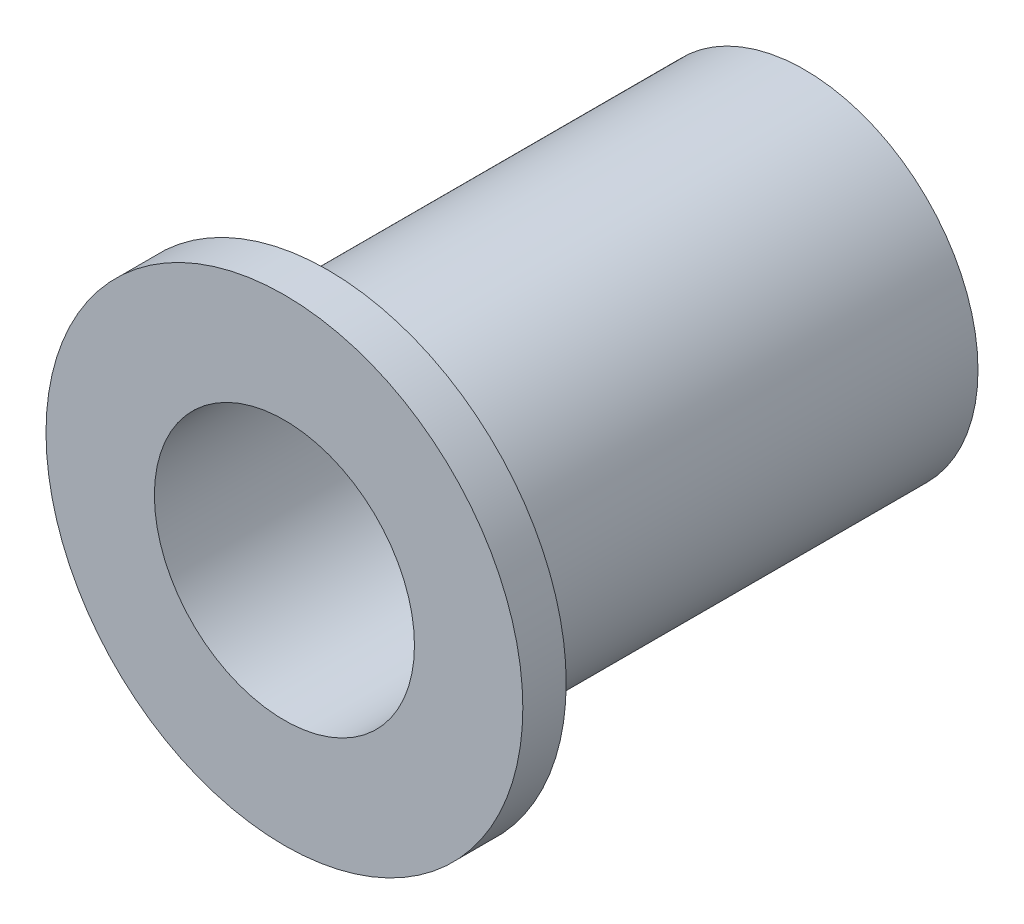
ISO-10303-21;
HEADER;
FILE_DESCRIPTION(('STEP AP214'),'2;1');
FILE_NAME('part.step','',(''),(''),'','','');
FILE_SCHEMA(('AUTOMOTIVE_DESIGN { 1 0 10303 214 1 1 1 1 }'));
ENDSEC;
DATA;
#1=APPLICATION_CONTEXT('core data for automotive mechanical design processes');
#2=APPLICATION_PROTOCOL_DEFINITION('international standard','automotive_design',2000,#1);
#3=PRODUCT_CONTEXT('',#1,'mechanical');
#4=PRODUCT('Part','Part','',(#3));
#5=PRODUCT_RELATED_PRODUCT_CATEGORY('part','',(#4));
#6=PRODUCT_DEFINITION_FORMATION('','',#4);
#7=PRODUCT_DEFINITION_CONTEXT('part definition',#1,'design');
#8=PRODUCT_DEFINITION('design','',#6,#7);
#9=PRODUCT_DEFINITION_SHAPE('','',#8);
#10=(LENGTH_UNIT() NAMED_UNIT(*) SI_UNIT(.MILLI.,.METRE.));
#11=(NAMED_UNIT(*) PLANE_ANGLE_UNIT() SI_UNIT($,.RADIAN.));
#12=(NAMED_UNIT(*) SI_UNIT($,.STERADIAN.) SOLID_ANGLE_UNIT());
#13=UNCERTAINTY_MEASURE_WITH_UNIT(LENGTH_MEASURE(1.E-05),#10,'distance_accuracy_value','');
#14=(GEOMETRIC_REPRESENTATION_CONTEXT(3) GLOBAL_UNCERTAINTY_ASSIGNED_CONTEXT((#13)) GLOBAL_UNIT_ASSIGNED_CONTEXT((#10,
#11,#12)) REPRESENTATION_CONTEXT('',''));
#15=CARTESIAN_POINT('',(0.,0.,0.));
#16=DIRECTION('',(0.,0.,1.));
#17=DIRECTION('',(1.,0.,0.));
#18=AXIS2_PLACEMENT_3D('',#15,#16,#17);
#19=CARTESIAN_POINT('',(0.,0.,19.05));
#20=DIRECTION('',(0.,0.,-1.));
#21=DIRECTION('',(-1.,0.,0.));
#22=AXIS2_PLACEMENT_3D('',#19,#20,#21);
#23=CYLINDRICAL_SURFACE('',#22,6.35);
#24=CARTESIAN_POINT('',(0.,0.,0.));
#25=DIRECTION('',(0.,0.,1.));
#26=DIRECTION('',(1.,0.,0.));
#27=AXIS2_PLACEMENT_3D('',#24,#25,#26);
#28=CIRCLE('',#27,6.35);
#29=CARTESIAN_POINT('',(6.35,0.,0.));
#30=VERTEX_POINT('',#29);
#31=EDGE_CURVE('E32',#30,#30,#28,.T.);
#32=ORIENTED_EDGE('',*,*,#31,.T.);
#33=EDGE_LOOP('',(#32));
#34=FACE_BOUND('',#33,.T.);
#35=CARTESIAN_POINT('',(0.,0.,17.4625));
#36=DIRECTION('',(0.,0.,1.));
#37=DIRECTION('',(1.,0.,0.));
#38=AXIS2_PLACEMENT_3D('',#35,#36,#37);
#39=CIRCLE('',#38,6.35);
#40=CARTESIAN_POINT('',(6.35,0.,17.4625));
#41=VERTEX_POINT('',#40);
#42=EDGE_CURVE('E10',#41,#41,#39,.T.);
#43=ORIENTED_EDGE('',*,*,#42,.F.);
#44=EDGE_LOOP('',(#43));
#45=FACE_BOUND('',#44,.T.);
#46=ADVANCED_FACE('F29',(#34,#45),#23,.T.);
#47=CARTESIAN_POINT('',(0.,0.,19.05));
#48=DIRECTION('',(0.,0.,1.));
#49=DIRECTION('',(1.,0.,0.));
#50=AXIS2_PLACEMENT_3D('',#47,#48,#49);
#51=PLANE('',#50);
#52=CARTESIAN_POINT('',(0.,0.,19.05));
#53=DIRECTION('',(0.,0.,1.));
#54=DIRECTION('',(1.,0.,0.));
#55=AXIS2_PLACEMENT_3D('',#52,#53,#54);
#56=CIRCLE('',#55,4.7625);
#57=CARTESIAN_POINT('',(4.7625,0.,19.05));
#58=VERTEX_POINT('',#57);
#59=EDGE_CURVE('E40',#58,#58,#56,.T.);
#60=ORIENTED_EDGE('',*,*,#59,.F.);
#61=EDGE_LOOP('',(#60));
#62=FACE_BOUND('',#61,.T.);
#63=CARTESIAN_POINT('',(0.,0.,19.05));
#64=DIRECTION('',(0.,0.,1.));
#65=DIRECTION('',(1.,0.,0.));
#66=AXIS2_PLACEMENT_3D('',#63,#64,#65);
#67=CIRCLE('',#66,8.73125);
#68=CARTESIAN_POINT('',(8.73125,0.,19.05));
#69=VERTEX_POINT('',#68);
#70=EDGE_CURVE('E43',#69,#69,#67,.T.);
#71=ORIENTED_EDGE('',*,*,#70,.T.);
#72=EDGE_LOOP('',(#71));
#73=FACE_BOUND('',#72,.T.);
#74=ADVANCED_FACE('F57',(#62,#73),#51,.T.);
#75=CARTESIAN_POINT('',(0.,0.,0.));
#76=DIRECTION('',(0.,0.,1.));
#77=DIRECTION('',(1.,0.,0.));
#78=AXIS2_PLACEMENT_3D('',#75,#76,#77);
#79=PLANE('',#78);
#80=ORIENTED_EDGE('',*,*,#31,.F.);
#81=EDGE_LOOP('',(#80));
#82=FACE_BOUND('',#81,.T.);
#83=CARTESIAN_POINT('',(0.,0.,0.));
#84=DIRECTION('',(0.,0.,1.));
#85=DIRECTION('',(1.,0.,0.));
#86=AXIS2_PLACEMENT_3D('',#83,#84,#85);
#87=CIRCLE('',#86,4.7625);
#88=CARTESIAN_POINT('',(4.7625,0.,0.));
#89=VERTEX_POINT('',#88);
#90=EDGE_CURVE('E46',#89,#89,#87,.T.);
#91=ORIENTED_EDGE('',*,*,#90,.T.);
#92=EDGE_LOOP('',(#91));
#93=FACE_BOUND('',#92,.T.);
#94=ADVANCED_FACE('F75',(#82,#93),#79,.F.);
#95=CARTESIAN_POINT('',(0.,0.,19.05));
#96=DIRECTION('',(0.,0.,-1.));
#97=DIRECTION('',(-1.,0.,0.));
#98=AXIS2_PLACEMENT_3D('',#95,#96,#97);
#99=CYLINDRICAL_SURFACE('',#98,4.7625);
#100=ORIENTED_EDGE('',*,*,#59,.T.);
#101=EDGE_LOOP('',(#100));
#102=FACE_BOUND('',#101,.T.);
#103=ORIENTED_EDGE('',*,*,#90,.F.);
#104=EDGE_LOOP('',(#103));
#105=FACE_BOUND('',#104,.T.);
#106=ADVANCED_FACE('F66',(#102,#105),#99,.F.);
#107=CARTESIAN_POINT('',(0.,0.,17.4625));
#108=DIRECTION('',(0.,0.,1.));
#109=DIRECTION('',(1.,0.,0.));
#110=AXIS2_PLACEMENT_3D('',#107,#108,#109);
#111=PLANE('',#110);
#112=CARTESIAN_POINT('',(0.,0.,17.4625));
#113=DIRECTION('',(0.,0.,1.));
#114=DIRECTION('',(1.,0.,0.));
#115=AXIS2_PLACEMENT_3D('',#112,#113,#114);
#116=CIRCLE('',#115,8.73125);
#117=CARTESIAN_POINT('',(8.73125,0.,17.4625));
#118=VERTEX_POINT('',#117);
#119=EDGE_CURVE('E48',#118,#118,#116,.T.);
#120=ORIENTED_EDGE('',*,*,#119,.F.);
#121=EDGE_LOOP('',(#120));
#122=FACE_BOUND('',#121,.T.);
#123=ORIENTED_EDGE('',*,*,#42,.T.);
#124=EDGE_LOOP('',(#123));
#125=FACE_BOUND('',#124,.T.);
#126=ADVANCED_FACE('F61',(#122,#125),#111,.F.);
#127=CARTESIAN_POINT('',(0.,0.,17.4625));
#128=DIRECTION('',(0.,0.,1.));
#129=DIRECTION('',(1.,0.,0.));
#130=AXIS2_PLACEMENT_3D('',#127,#128,#129);
#131=CYLINDRICAL_SURFACE('',#130,8.73125);
#132=ORIENTED_EDGE('',*,*,#119,.T.);
#133=EDGE_LOOP('',(#132));
#134=FACE_BOUND('',#133,.T.);
#135=ORIENTED_EDGE('',*,*,#70,.F.);
#136=EDGE_LOOP('',(#135));
#137=FACE_BOUND('',#136,.T.);
#138=ADVANCED_FACE('F59',(#134,#137),#131,.T.);
#139=CLOSED_SHELL('',(#46,#74,#94,#106,#126,#138));
#140=MANIFOLD_SOLID_BREP('B2',#139);
#141=ADVANCED_BREP_SHAPE_REPRESENTATION('',(#18,#140),#14);
#142=SHAPE_DEFINITION_REPRESENTATION(#9,#141);
ENDSEC;
END-ISO-10303-21;
